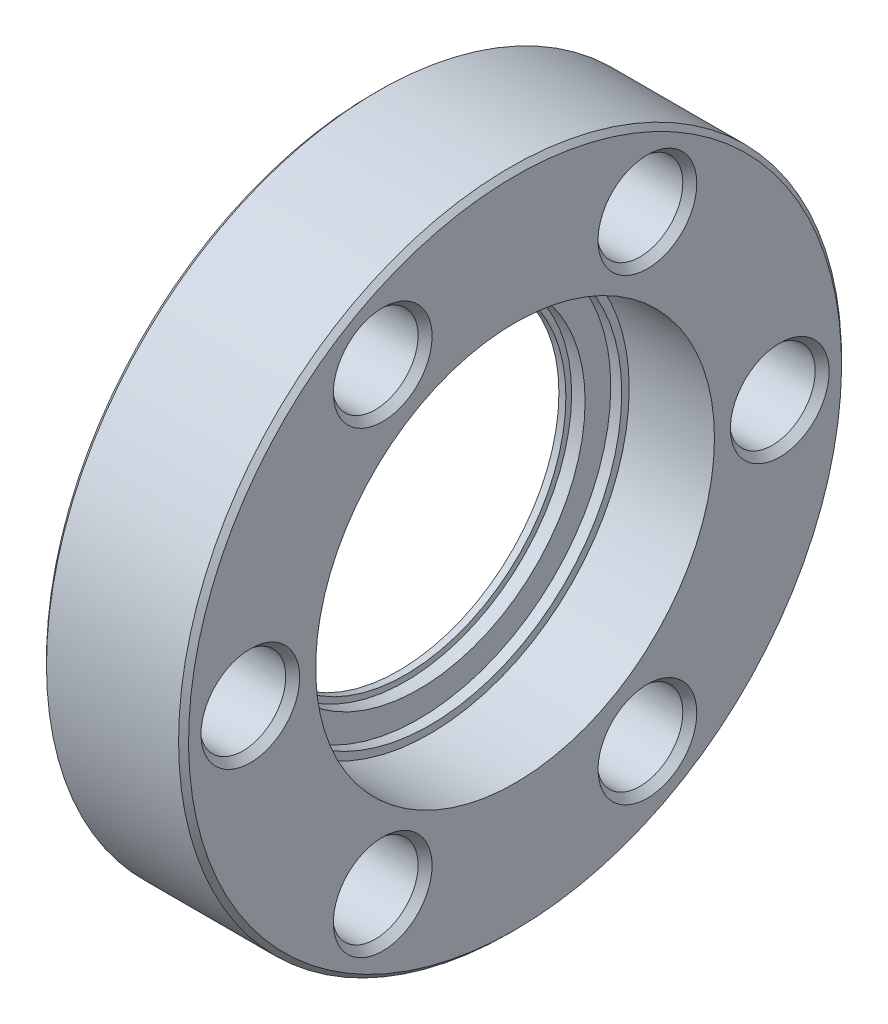
ISO-10303-21;
HEADER;
FILE_DESCRIPTION(('STEP AP214'),'2;1');
FILE_NAME('part.step','',(''),(''),'','','');
FILE_SCHEMA(('AUTOMOTIVE_DESIGN { 1 0 10303 214 1 1 1 1 }'));
ENDSEC;
DATA;
#1=APPLICATION_CONTEXT('core data for automotive mechanical design processes');
#2=APPLICATION_PROTOCOL_DEFINITION('international standard','automotive_design',2000,#1);
#3=PRODUCT_CONTEXT('',#1,'mechanical');
#4=PRODUCT('Part','Part','',(#3));
#5=PRODUCT_RELATED_PRODUCT_CATEGORY('part','',(#4));
#6=PRODUCT_DEFINITION_FORMATION('','',#4);
#7=PRODUCT_DEFINITION_CONTEXT('part definition',#1,'design');
#8=PRODUCT_DEFINITION('design','',#6,#7);
#9=PRODUCT_DEFINITION_SHAPE('','',#8);
#10=(LENGTH_UNIT() NAMED_UNIT(*) SI_UNIT(.MILLI.,.METRE.));
#11=(NAMED_UNIT(*) PLANE_ANGLE_UNIT() SI_UNIT($,.RADIAN.));
#12=(NAMED_UNIT(*) SI_UNIT($,.STERADIAN.) SOLID_ANGLE_UNIT());
#13=UNCERTAINTY_MEASURE_WITH_UNIT(LENGTH_MEASURE(1.E-05),#10,'distance_accuracy_value','');
#14=(GEOMETRIC_REPRESENTATION_CONTEXT(3) GLOBAL_UNCERTAINTY_ASSIGNED_CONTEXT((#13)) GLOBAL_UNIT_ASSIGNED_CONTEXT((#10,
#11,#12)) REPRESENTATION_CONTEXT('',''));
#15=CARTESIAN_POINT('',(0.,0.,0.));
#16=DIRECTION('',(0.,0.,1.));
#17=DIRECTION('',(1.,0.,0.));
#18=AXIS2_PLACEMENT_3D('',#15,#16,#17);
#19=CARTESIAN_POINT('',(1.2954,0.,0.));
#20=DIRECTION('',(1.,0.,0.));
#21=DIRECTION('',(0.,0.,-1.));
#22=AXIS2_PLACEMENT_3D('',#19,#20,#21);
#23=PLANE('',#22);
#24=CARTESIAN_POINT('',(1.2954,0.,0.));
#25=DIRECTION('',(-1.,0.,0.));
#26=DIRECTION('',(0.,0.,1.));
#27=AXIS2_PLACEMENT_3D('',#24,#25,#26);
#28=CIRCLE('',#27,9.144);
#29=CARTESIAN_POINT('',(1.2954,0.,9.144));
#30=VERTEX_POINT('',#29);
#31=EDGE_CURVE('E96',#30,#30,#28,.T.);
#32=ORIENTED_EDGE('',*,*,#31,.T.);
#33=EDGE_LOOP('',(#32));
#34=FACE_BOUND('',#33,.T.);
#35=CARTESIAN_POINT('',(1.2954,0.,0.));
#36=DIRECTION('',(1.,0.,0.));
#37=DIRECTION('',(0.,0.,-1.));
#38=AXIS2_PLACEMENT_3D('',#35,#36,#37);
#39=CIRCLE('',#38,8.1788);
#40=CARTESIAN_POINT('',(1.2954,0.,-8.1788));
#41=VERTEX_POINT('',#40);
#42=EDGE_CURVE('E18',#41,#41,#39,.T.);
#43=ORIENTED_EDGE('',*,*,#42,.T.);
#44=EDGE_LOOP('',(#43));
#45=FACE_BOUND('',#44,.T.);
#46=ADVANCED_FACE('F15',(#34,#45),#23,.F.);
#47=CARTESIAN_POINT('',(0.,0.,0.));
#48=DIRECTION('',(1.,0.,0.));
#49=DIRECTION('',(0.,0.,-1.));
#50=AXIS2_PLACEMENT_3D('',#47,#48,#49);
#51=CYLINDRICAL_SURFACE('',#50,8.1788);
#52=ORIENTED_EDGE('',*,*,#42,.F.);
#53=EDGE_LOOP('',(#52));
#54=FACE_BOUND('',#53,.T.);
#55=CARTESIAN_POINT('',(1.651,0.,0.));
#56=DIRECTION('',(1.,0.,0.));
#57=DIRECTION('',(0.,0.,-1.));
#58=AXIS2_PLACEMENT_3D('',#55,#56,#57);
#59=CIRCLE('',#58,8.1788);
#60=CARTESIAN_POINT('',(1.651,0.,-8.1788));
#61=VERTEX_POINT('',#60);
#62=EDGE_CURVE('E94',#61,#61,#59,.F.);
#63=ORIENTED_EDGE('',*,*,#62,.F.);
#64=EDGE_LOOP('',(#63));
#65=FACE_BOUND('',#64,.T.);
#66=ADVANCED_FACE('F104',(#54,#65),#51,.F.);
#67=CARTESIAN_POINT('',(1.2954,0.,0.));
#68=DIRECTION('',(-1.,0.,0.));
#69=DIRECTION('',(0.,0.,1.));
#70=AXIS2_PLACEMENT_3D('',#67,#68,#69);
#71=CYLINDRICAL_SURFACE('',#70,9.144);
#72=ORIENTED_EDGE('',*,*,#31,.F.);
#73=EDGE_LOOP('',(#72));
#74=FACE_BOUND('',#73,.T.);
#75=CARTESIAN_POINT('',(0.6604,0.,0.));
#76=DIRECTION('',(1.,0.,0.));
#77=DIRECTION('',(0.,0.,-1.));
#78=AXIS2_PLACEMENT_3D('',#75,#76,#77);
#79=CIRCLE('',#78,9.144);
#80=CARTESIAN_POINT('',(0.6604,0.,-9.144));
#81=VERTEX_POINT('',#80);
#82=EDGE_CURVE('E30',#81,#81,#79,.T.);
#83=ORIENTED_EDGE('',*,*,#82,.F.);
#84=EDGE_LOOP('',(#83));
#85=FACE_BOUND('',#84,.T.);
#86=ADVANCED_FACE('F107',(#74,#85),#71,.F.);
#87=CARTESIAN_POINT('',(1.651,0.,0.));
#88=DIRECTION('',(1.,0.,0.));
#89=DIRECTION('',(0.,0.,-1.));
#90=AXIS2_PLACEMENT_3D('',#87,#88,#89);
#91=PLANE('',#90);
#92=ORIENTED_EDGE('',*,*,#62,.T.);
#93=EDGE_LOOP('',(#92));
#94=FACE_BOUND('',#93,.T.);
#95=CARTESIAN_POINT('',(1.651,0.,0.));
#96=DIRECTION('',(1.,0.,0.));
#97=DIRECTION('',(0.,0.,-1.));
#98=AXIS2_PLACEMENT_3D('',#95,#96,#97);
#99=CIRCLE('',#98,8.4709);
#100=CARTESIAN_POINT('',(1.651,0.,-8.4709));
#101=VERTEX_POINT('',#100);
#102=EDGE_CURVE('E91',#101,#101,#99,.T.);
#103=ORIENTED_EDGE('',*,*,#102,.T.);
#104=EDGE_LOOP('',(#103));
#105=FACE_BOUND('',#104,.T.);
#106=ADVANCED_FACE('F110',(#94,#105),#91,.T.);
#107=CARTESIAN_POINT('',(1.2335803249224,0.,0.));
#108=DIRECTION('',(1.,0.,0.));
#109=DIRECTION('',(0.,0.,-1.));
#110=AXIS2_PLACEMENT_3D('',#107,#108,#109);
#111=CONICAL_SURFACE('',#110,10.7188,1.22173047639604);
#112=CARTESIAN_POINT('',(1.2335803249224,0.,0.));
#113=DIRECTION('',(1.,0.,0.));
#114=DIRECTION('',(0.,0.,-1.));
#115=AXIS2_PLACEMENT_3D('',#112,#113,#114);
#116=CIRCLE('',#115,10.7188);
#117=CARTESIAN_POINT('',(1.2335803249224,0.,-10.7188));
#118=VERTEX_POINT('',#117);
#119=EDGE_CURVE('E90',#118,#118,#116,.F.);
#120=ORIENTED_EDGE('',*,*,#119,.T.);
#121=EDGE_LOOP('',(#120));
#122=FACE_BOUND('',#121,.T.);
#123=ORIENTED_EDGE('',*,*,#82,.T.);
#124=EDGE_LOOP('',(#123));
#125=FACE_BOUND('',#124,.T.);
#126=ADVANCED_FACE('F113',(#122,#125),#111,.T.);
#127=CARTESIAN_POINT('',(1.651,0.,0.));
#128=DIRECTION('',(1.,0.,0.));
#129=DIRECTION('',(0.,0.,-1.));
#130=AXIS2_PLACEMENT_3D('',#127,#128,#129);
#131=CYLINDRICAL_SURFACE('',#130,8.4709);
#132=ORIENTED_EDGE('',*,*,#102,.F.);
#133=EDGE_LOOP('',(#132));
#134=FACE_BOUND('',#133,.T.);
#135=CARTESIAN_POINT('',(2.3368,0.,0.));
#136=DIRECTION('',(1.,0.,0.));
#137=DIRECTION('',(0.,0.,-1.));
#138=AXIS2_PLACEMENT_3D('',#135,#136,#137);
#139=CIRCLE('',#138,8.4709);
#140=CARTESIAN_POINT('',(2.3368,0.,-8.4709));
#141=VERTEX_POINT('',#140);
#142=EDGE_CURVE('E87',#141,#141,#139,.F.);
#143=ORIENTED_EDGE('',*,*,#142,.F.);
#144=EDGE_LOOP('',(#143));
#145=FACE_BOUND('',#144,.T.);
#146=ADVANCED_FACE('F117',(#134,#145),#131,.F.);
#147=CARTESIAN_POINT('',(7.239,0.,0.));
#148=DIRECTION('',(1.,0.,0.));
#149=DIRECTION('',(0.,0.,-1.));
#150=AXIS2_PLACEMENT_3D('',#147,#148,#149);
#151=CYLINDRICAL_SURFACE('',#150,10.7188);
#152=CARTESIAN_POINT('',(0.,0.,0.));
#153=DIRECTION('',(1.,0.,0.));
#154=DIRECTION('',(0.,0.,-1.));
#155=AXIS2_PLACEMENT_3D('',#152,#153,#154);
#156=CIRCLE('',#155,10.7188);
#157=CARTESIAN_POINT('',(0.,0.,-10.7188));
#158=VERTEX_POINT('',#157);
#159=EDGE_CURVE('E84',#158,#158,#156,.F.);
#160=ORIENTED_EDGE('',*,*,#159,.T.);
#161=EDGE_LOOP('',(#160));
#162=FACE_BOUND('',#161,.T.);
#163=ORIENTED_EDGE('',*,*,#119,.F.);
#164=EDGE_LOOP('',(#163));
#165=FACE_BOUND('',#164,.T.);
#166=ADVANCED_FACE('F120',(#162,#165),#151,.F.);
#167=CARTESIAN_POINT('',(2.3368,0.,0.));
#168=DIRECTION('',(1.,0.,0.));
#169=DIRECTION('',(0.,0.,-1.));
#170=AXIS2_PLACEMENT_3D('',#167,#168,#169);
#171=PLANE('',#170);
#172=ORIENTED_EDGE('',*,*,#142,.T.);
#173=EDGE_LOOP('',(#172));
#174=FACE_BOUND('',#173,.T.);
#175=CARTESIAN_POINT('',(2.3368,0.,0.));
#176=DIRECTION('',(1.,0.,0.));
#177=DIRECTION('',(0.,0.,-1.));
#178=AXIS2_PLACEMENT_3D('',#175,#176,#177);
#179=CIRCLE('',#178,9.779);
#180=CARTESIAN_POINT('',(2.3368,0.,-9.779));
#181=VERTEX_POINT('',#180);
#182=EDGE_CURVE('E81',#181,#181,#179,.T.);
#183=ORIENTED_EDGE('',*,*,#182,.T.);
#184=EDGE_LOOP('',(#183));
#185=FACE_BOUND('',#184,.T.);
#186=ADVANCED_FACE('F124',(#174,#185),#171,.T.);
#187=CARTESIAN_POINT('',(0.,0.,0.));
#188=DIRECTION('',(1.,0.,0.));
#189=DIRECTION('',(0.,0.,-1.));
#190=AXIS2_PLACEMENT_3D('',#187,#188,#189);
#191=PLANE('',#190);
#192=ORIENTED_EDGE('',*,*,#159,.F.);
#193=EDGE_LOOP('',(#192));
#194=FACE_BOUND('',#193,.T.);
#195=CARTESIAN_POINT('',(0.,0.,0.));
#196=DIRECTION('',(1.,0.,0.));
#197=DIRECTION('',(0.,0.,-1.));
#198=AXIS2_PLACEMENT_3D('',#195,#196,#197);
#199=CIRCLE('',#198,16.637);
#200=CARTESIAN_POINT('',(0.,0.,-16.637));
#201=VERTEX_POINT('',#200);
#202=EDGE_CURVE('E60',#201,#201,#199,.T.);
#203=ORIENTED_EDGE('',*,*,#202,.F.);
#204=EDGE_LOOP('',(#203));
#205=FACE_BOUND('',#204,.T.);
#206=CARTESIAN_POINT('',(0.,11.6804310310022,-6.74370000000002));
#207=DIRECTION('',(-1.,0.,0.));
#208=DIRECTION('',(0.,0.,1.));
#209=AXIS2_PLACEMENT_3D('',#206,#207,#208);
#210=CIRCLE('',#209,2.56540000002181);
#211=CARTESIAN_POINT('',(0.,11.6804310310022,-4.17829999997821));
#212=VERTEX_POINT('',#211);
#213=EDGE_CURVE('E63',#212,#212,#210,.F.);
#214=ORIENTED_EDGE('',*,*,#213,.T.);
#215=EDGE_LOOP('',(#214));
#216=FACE_BOUND('',#215,.T.);
#217=CARTESIAN_POINT('',(-5.6843418860808E-11,0.,-13.4874));
#218=DIRECTION('',(-1.,0.,0.));
#219=DIRECTION('',(0.,0.,1.));
#220=AXIS2_PLACEMENT_3D('',#217,#218,#219);
#221=CIRCLE('',#220,2.56540000004833);
#222=CARTESIAN_POINT('',(-5.6843418860808E-11,0.,-10.9219999999517));
#223=VERTEX_POINT('',#222);
#224=EDGE_CURVE('E66',#223,#223,#221,.F.);
#225=ORIENTED_EDGE('',*,*,#224,.T.);
#226=EDGE_LOOP('',(#225));
#227=FACE_BOUND('',#226,.T.);
#228=CARTESIAN_POINT('',(0.,-11.6804310310023,-6.74369999999993));
#229=DIRECTION('',(-1.,0.,0.));
#230=DIRECTION('',(0.,0.,1.));
#231=AXIS2_PLACEMENT_3D('',#228,#229,#230);
#232=CIRCLE('',#231,2.56539999996488);
#233=CARTESIAN_POINT('',(0.,-11.6804310310023,-4.17830000003505));
#234=VERTEX_POINT('',#233);
#235=EDGE_CURVE('E69',#234,#234,#232,.F.);
#236=ORIENTED_EDGE('',*,*,#235,.T.);
#237=EDGE_LOOP('',(#236));
#238=FACE_BOUND('',#237,.T.);
#239=CARTESIAN_POINT('',(0.,-11.6804310310022,6.7437000000001));
#240=DIRECTION('',(-1.,0.,0.));
#241=DIRECTION('',(0.,0.,1.));
#242=AXIS2_PLACEMENT_3D('',#239,#240,#241);
#243=CIRCLE('',#242,2.56539999999575);
#244=CARTESIAN_POINT('',(0.,-11.6804310310022,9.30909999999585));
#245=VERTEX_POINT('',#244);
#246=EDGE_CURVE('E72',#245,#245,#243,.F.);
#247=ORIENTED_EDGE('',*,*,#246,.T.);
#248=EDGE_LOOP('',(#247));
#249=FACE_BOUND('',#248,.T.);
#250=CARTESIAN_POINT('',(-5.6843418860808E-11,1.43982048506075E-13,13.4874));
#251=DIRECTION('',(-1.,0.,0.));
#252=DIRECTION('',(0.,0.,1.));
#253=AXIS2_PLACEMENT_3D('',#250,#251,#252);
#254=CIRCLE('',#253,2.5654000000113);
#255=CARTESIAN_POINT('',(-5.6843418860808E-11,1.43982048506075E-13,16.0528000000113));
#256=VERTEX_POINT('',#255);
#257=EDGE_CURVE('E75',#256,#256,#254,.F.);
#258=ORIENTED_EDGE('',*,*,#257,.T.);
#259=EDGE_LOOP('',(#258));
#260=FACE_BOUND('',#259,.T.);
#261=CARTESIAN_POINT('',(5.6843418860808E-11,11.6804310310023,6.74369999999985));
#262=DIRECTION('',(-1.,0.,0.));
#263=DIRECTION('',(0.,0.,1.));
#264=AXIS2_PLACEMENT_3D('',#261,#262,#263);
#265=CIRCLE('',#264,2.56540000009483);
#266=CARTESIAN_POINT('',(5.6843418860808E-11,11.6804310310023,9.30910000009468));
#267=VERTEX_POINT('',#266);
#268=EDGE_CURVE('E78',#267,#267,#265,.F.);
#269=ORIENTED_EDGE('',*,*,#268,.T.);
#270=EDGE_LOOP('',(#269));
#271=FACE_BOUND('',#270,.T.);
#272=ADVANCED_FACE('F127',(#194,#205,#216,#227,#238,#249,#260,#271),#191,.F.);
#273=CARTESIAN_POINT('',(2.3368,0.,0.));
#274=DIRECTION('',(1.,0.,0.));
#275=DIRECTION('',(0.,0.,-1.));
#276=AXIS2_PLACEMENT_3D('',#273,#274,#275);
#277=CYLINDRICAL_SURFACE('',#276,9.779);
#278=ORIENTED_EDGE('',*,*,#182,.F.);
#279=EDGE_LOOP('',(#278));
#280=FACE_BOUND('',#279,.T.);
#281=CARTESIAN_POINT('',(2.8956,0.,0.));
#282=DIRECTION('',(1.,0.,0.));
#283=DIRECTION('',(0.,0.,-1.));
#284=AXIS2_PLACEMENT_3D('',#281,#282,#283);
#285=CIRCLE('',#284,9.779);
#286=CARTESIAN_POINT('',(2.8956,0.,-9.779));
#287=VERTEX_POINT('',#286);
#288=EDGE_CURVE('E56',#287,#287,#285,.F.);
#289=ORIENTED_EDGE('',*,*,#288,.F.);
#290=EDGE_LOOP('',(#289));
#291=FACE_BOUND('',#290,.T.);
#292=ADVANCED_FACE('F131',(#280,#291),#277,.F.);
#293=CARTESIAN_POINT('',(1.70530256582424E-10,11.6804310310023,6.74369999999985));
#294=DIRECTION('',(-1.,0.,0.));
#295=DIRECTION('',(0.,0.,1.));
#296=AXIS2_PLACEMENT_3D('',#293,#294,#295);
#297=CONICAL_SURFACE('',#296,2.565399999996,0.715584993335024);
#298=CARTESIAN_POINT('',(0.438290363151198,11.6804310310023,6.74369999999985));
#299=DIRECTION('',(-1.,0.,0.));
#300=DIRECTION('',(0.,0.,1.));
#301=AXIS2_PLACEMENT_3D('',#298,#299,#300);
#302=CIRCLE('',#301,2.1844);
#303=CARTESIAN_POINT('',(0.438290363151198,11.6804310310023,8.92809999999985));
#304=VERTEX_POINT('',#303);
#305=EDGE_CURVE('E59',#304,#304,#302,.F.);
#306=ORIENTED_EDGE('',*,*,#305,.T.);
#307=EDGE_LOOP('',(#306));
#308=FACE_BOUND('',#307,.T.);
#309=ORIENTED_EDGE('',*,*,#268,.F.);
#310=EDGE_LOOP('',(#309));
#311=FACE_BOUND('',#310,.T.);
#312=ADVANCED_FACE('F134',(#308,#311),#297,.F.);
#313=CARTESIAN_POINT('',(-5.6843418860808E-11,1.43982048506075E-13,13.4874));
#314=DIRECTION('',(-1.,0.,0.));
#315=DIRECTION('',(0.,0.,1.));
#316=AXIS2_PLACEMENT_3D('',#313,#314,#315);
#317=CONICAL_SURFACE('',#316,2.5654000000113,0.715584993325368);
#318=CARTESIAN_POINT('',(0.438290363151205,1.43982048506075E-13,13.4874));
#319=DIRECTION('',(-1.,0.,0.));
#320=DIRECTION('',(0.,0.,1.));
#321=AXIS2_PLACEMENT_3D('',#318,#319,#320);
#322=CIRCLE('',#321,2.1844);
#323=CARTESIAN_POINT('',(0.438290363151205,1.43982048506075E-13,15.6718));
#324=VERTEX_POINT('',#323);
#325=EDGE_CURVE('E229',#324,#324,#322,.F.);
#326=ORIENTED_EDGE('',*,*,#325,.T.);
#327=EDGE_LOOP('',(#326));
#328=FACE_BOUND('',#327,.T.);
#329=ORIENTED_EDGE('',*,*,#257,.F.);
#330=EDGE_LOOP('',(#329));
#331=FACE_BOUND('',#330,.T.);
#332=ADVANCED_FACE('F307',(#328,#331),#317,.F.);
#333=CARTESIAN_POINT('',(0.,-11.6804310310022,6.7437000000001));
#334=DIRECTION('',(-1.,0.,0.));
#335=DIRECTION('',(0.,0.,1.));
#336=AXIS2_PLACEMENT_3D('',#333,#334,#335);
#337=CONICAL_SURFACE('',#336,2.56539999999575,0.715584993335024);
#338=CARTESIAN_POINT('',(0.438290363151198,-11.6804310310022,6.7437000000001));
#339=DIRECTION('',(-1.,0.,0.));
#340=DIRECTION('',(0.,0.,1.));
#341=AXIS2_PLACEMENT_3D('',#338,#339,#340);
#342=CIRCLE('',#341,2.1844);
#343=CARTESIAN_POINT('',(0.438290363151198,-11.6804310310022,8.9281000000001));
#344=VERTEX_POINT('',#343);
#345=EDGE_CURVE('E226',#344,#344,#342,.F.);
#346=ORIENTED_EDGE('',*,*,#345,.T.);
#347=EDGE_LOOP('',(#346));
#348=FACE_BOUND('',#347,.T.);
#349=ORIENTED_EDGE('',*,*,#246,.F.);
#350=EDGE_LOOP('',(#349));
#351=FACE_BOUND('',#350,.T.);
#352=ADVANCED_FACE('F317',(#348,#351),#337,.F.);
#353=CARTESIAN_POINT('',(0.,-11.6804310310023,-6.74369999999993));
#354=DIRECTION('',(-1.,0.,0.));
#355=DIRECTION('',(0.,0.,1.));
#356=AXIS2_PLACEMENT_3D('',#353,#354,#355);
#357=CONICAL_SURFACE('',#356,2.56539999996488,0.715584993325368);
#358=CARTESIAN_POINT('',(0.438290363151204,-11.6804310310023,-6.74369999999993));
#359=DIRECTION('',(-1.,0.,0.));
#360=DIRECTION('',(0.,0.,1.));
#361=AXIS2_PLACEMENT_3D('',#358,#359,#360);
#362=CIRCLE('',#361,2.1844);
#363=CARTESIAN_POINT('',(0.438290363151204,-11.6804310310023,-4.55929999999993));
#364=VERTEX_POINT('',#363);
#365=EDGE_CURVE('E223',#364,#364,#362,.F.);
#366=ORIENTED_EDGE('',*,*,#365,.T.);
#367=EDGE_LOOP('',(#366));
#368=FACE_BOUND('',#367,.T.);
#369=ORIENTED_EDGE('',*,*,#235,.F.);
#370=EDGE_LOOP('',(#369));
#371=FACE_BOUND('',#370,.T.);
#372=ADVANCED_FACE('F327',(#368,#371),#357,.F.);
#373=CARTESIAN_POINT('',(5.6843418860808E-11,0.,-13.4874));
#374=DIRECTION('',(-1.,0.,0.));
#375=DIRECTION('',(0.,0.,1.));
#376=AXIS2_PLACEMENT_3D('',#373,#374,#375);
#377=CONICAL_SURFACE('',#376,2.5653999999495,0.715584993335024);
#378=CARTESIAN_POINT('',(0.438290363151191,0.,-13.4874));
#379=DIRECTION('',(-1.,0.,0.));
#380=DIRECTION('',(0.,0.,1.));
#381=AXIS2_PLACEMENT_3D('',#378,#379,#380);
#382=CIRCLE('',#381,2.1844);
#383=CARTESIAN_POINT('',(0.438290363151191,0.,-11.303));
#384=VERTEX_POINT('',#383);
#385=EDGE_CURVE('E220',#384,#384,#382,.F.);
#386=ORIENTED_EDGE('',*,*,#385,.T.);
#387=EDGE_LOOP('',(#386));
#388=FACE_BOUND('',#387,.T.);
#389=ORIENTED_EDGE('',*,*,#224,.F.);
#390=EDGE_LOOP('',(#389));
#391=FACE_BOUND('',#390,.T.);
#392=ADVANCED_FACE('F337',(#388,#391),#377,.F.);
#393=CARTESIAN_POINT('',(0.,11.6804310310022,-6.74370000000002));
#394=DIRECTION('',(-1.,0.,0.));
#395=DIRECTION('',(0.,0.,1.));
#396=AXIS2_PLACEMENT_3D('',#393,#394,#395);
#397=CONICAL_SURFACE('',#396,2.56540000002181,0.715584993335024);
#398=CARTESIAN_POINT('',(0.438290363151198,11.6804310310022,-6.74370000000002));
#399=DIRECTION('',(-1.,0.,0.));
#400=DIRECTION('',(0.,0.,1.));
#401=AXIS2_PLACEMENT_3D('',#398,#399,#400);
#402=CIRCLE('',#401,2.1844);
#403=CARTESIAN_POINT('',(0.438290363151198,11.6804310310022,-4.55930000000002));
#404=VERTEX_POINT('',#403);
#405=EDGE_CURVE('E217',#404,#404,#402,.F.);
#406=ORIENTED_EDGE('',*,*,#405,.T.);
#407=EDGE_LOOP('',(#406));
#408=FACE_BOUND('',#407,.T.);
#409=ORIENTED_EDGE('',*,*,#213,.F.);
#410=EDGE_LOOP('',(#409));
#411=FACE_BOUND('',#410,.T.);
#412=ADVANCED_FACE('F347',(#408,#411),#397,.F.);
#413=CARTESIAN_POINT('',(0.253999999999993,0.,0.));
#414=DIRECTION('',(1.,0.,0.));
#415=DIRECTION('',(0.,0.,-1.));
#416=AXIS2_PLACEMENT_3D('',#413,#414,#415);
#417=CONICAL_SURFACE('',#416,16.891,0.785398163397442);
#418=CARTESIAN_POINT('',(0.253999999999994,0.,0.));
#419=DIRECTION('',(-1.,0.,0.));
#420=DIRECTION('',(0.,0.,1.));
#421=AXIS2_PLACEMENT_3D('',#418,#419,#420);
#422=CIRCLE('',#421,16.891);
#423=CARTESIAN_POINT('',(0.253999999999994,0.,16.891));
#424=VERTEX_POINT('',#423);
#425=EDGE_CURVE('E55',#424,#424,#422,.F.);
#426=ORIENTED_EDGE('',*,*,#425,.F.);
#427=EDGE_LOOP('',(#426));
#428=FACE_BOUND('',#427,.T.);
#429=ORIENTED_EDGE('',*,*,#202,.T.);
#430=EDGE_LOOP('',(#429));
#431=FACE_BOUND('',#430,.T.);
#432=ADVANCED_FACE('F142',(#428,#431),#417,.T.);
#433=CARTESIAN_POINT('',(2.8956,0.,0.));
#434=DIRECTION('',(1.,0.,0.));
#435=DIRECTION('',(0.,0.,-1.));
#436=AXIS2_PLACEMENT_3D('',#433,#434,#435);
#437=PLANE('',#436);
#438=ORIENTED_EDGE('',*,*,#288,.T.);
#439=EDGE_LOOP('',(#438));
#440=FACE_BOUND('',#439,.T.);
#441=CARTESIAN_POINT('',(2.8956,0.,0.));
#442=DIRECTION('',(1.,0.,0.));
#443=DIRECTION('',(0.,0.,-1.));
#444=AXIS2_PLACEMENT_3D('',#441,#442,#443);
#445=CIRCLE('',#444,10.16);
#446=CARTESIAN_POINT('',(2.8956,0.,-10.16));
#447=VERTEX_POINT('',#446);
#448=EDGE_CURVE('E51',#447,#447,#445,.T.);
#449=ORIENTED_EDGE('',*,*,#448,.T.);
#450=EDGE_LOOP('',(#449));
#451=FACE_BOUND('',#450,.T.);
#452=ADVANCED_FACE('F138',(#440,#451),#437,.T.);
#453=CARTESIAN_POINT('',(7.239,11.6804310310023,6.74369999999985));
#454=DIRECTION('',(-1.,0.,0.));
#455=DIRECTION('',(0.,0.,1.));
#456=AXIS2_PLACEMENT_3D('',#453,#454,#455);
#457=CYLINDRICAL_SURFACE('',#456,2.1844);
#458=CARTESIAN_POINT('',(6.85800000002246,11.6804310310023,6.74369999999985));
#459=DIRECTION('',(1.,0.,0.));
#460=DIRECTION('',(0.,0.,-1.));
#461=AXIS2_PLACEMENT_3D('',#458,#459,#460);
#462=CIRCLE('',#461,2.18439999990355);
#463=CARTESIAN_POINT('',(6.85800000002246,11.6804310310023,4.5593000000963));
#464=VERTEX_POINT('',#463);
#465=EDGE_CURVE('E54',#464,#464,#462,.T.);
#466=ORIENTED_EDGE('',*,*,#465,.T.);
#467=EDGE_LOOP('',(#466));
#468=FACE_BOUND('',#467,.T.);
#469=ORIENTED_EDGE('',*,*,#305,.F.);
#470=EDGE_LOOP('',(#469));
#471=FACE_BOUND('',#470,.T.);
#472=ADVANCED_FACE('F141',(#468,#471),#457,.F.);
#473=CARTESIAN_POINT('',(7.239,1.43982048506075E-13,13.4874));
#474=DIRECTION('',(-1.,0.,0.));
#475=DIRECTION('',(0.,0.,1.));
#476=AXIS2_PLACEMENT_3D('',#473,#474,#475);
#477=CYLINDRICAL_SURFACE('',#476,2.1844);
#478=CARTESIAN_POINT('',(6.85800000002246,1.43982048506075E-13,13.4874));
#479=DIRECTION('',(1.,0.,0.));
#480=DIRECTION('',(0.,0.,-1.));
#481=AXIS2_PLACEMENT_3D('',#478,#479,#480);
#482=CIRCLE('',#481,2.18440000000194);
#483=CARTESIAN_POINT('',(6.85800000002246,1.43982048506075E-13,11.3029999999981));
#484=VERTEX_POINT('',#483);
#485=EDGE_CURVE('E198',#484,#484,#482,.T.);
#486=ORIENTED_EDGE('',*,*,#485,.T.);
#487=EDGE_LOOP('',(#486));
#488=FACE_BOUND('',#487,.T.);
#489=ORIENTED_EDGE('',*,*,#325,.F.);
#490=EDGE_LOOP('',(#489));
#491=FACE_BOUND('',#490,.T.);
#492=ADVANCED_FACE('F381',(#488,#491),#477,.F.);
#493=CARTESIAN_POINT('',(7.239,-11.6804310310022,6.7437000000001));
#494=DIRECTION('',(-1.,0.,0.));
#495=DIRECTION('',(0.,0.,1.));
#496=AXIS2_PLACEMENT_3D('',#493,#494,#495);
#497=CYLINDRICAL_SURFACE('',#496,2.1844);
#498=CARTESIAN_POINT('',(6.85800000002246,-11.6804310310022,6.7437000000001));
#499=DIRECTION('',(1.,0.,0.));
#500=DIRECTION('',(0.,0.,-1.));
#501=AXIS2_PLACEMENT_3D('',#498,#499,#500);
#502=CIRCLE('',#501,2.18440000001749);
#503=CARTESIAN_POINT('',(6.85800000002246,-11.6804310310022,4.55929999998261));
#504=VERTEX_POINT('',#503);
#505=EDGE_CURVE('E206',#504,#504,#502,.T.);
#506=ORIENTED_EDGE('',*,*,#505,.T.);
#507=EDGE_LOOP('',(#506));
#508=FACE_BOUND('',#507,.T.);
#509=ORIENTED_EDGE('',*,*,#345,.F.);
#510=EDGE_LOOP('',(#509));
#511=FACE_BOUND('',#510,.T.);
#512=ADVANCED_FACE('F391',(#508,#511),#497,.F.);
#513=CARTESIAN_POINT('',(7.239,-11.6804310310023,-6.74369999999993));
#514=DIRECTION('',(-1.,0.,0.));
#515=DIRECTION('',(0.,0.,1.));
#516=AXIS2_PLACEMENT_3D('',#513,#514,#515);
#517=CYLINDRICAL_SURFACE('',#516,2.1844);
#518=CARTESIAN_POINT('',(6.85799999996561,-11.6804310310023,-6.74369999999993));
#519=DIRECTION('',(1.,0.,0.));
#520=DIRECTION('',(0.,0.,-1.));
#521=AXIS2_PLACEMENT_3D('',#518,#519,#520);
#522=CIRCLE('',#521,2.18440000004836);
#523=CARTESIAN_POINT('',(6.85799999996561,-11.6804310310023,-8.92810000004829));
#524=VERTEX_POINT('',#523);
#525=EDGE_CURVE('E209',#524,#524,#522,.T.);
#526=ORIENTED_EDGE('',*,*,#525,.T.);
#527=EDGE_LOOP('',(#526));
#528=FACE_BOUND('',#527,.T.);
#529=ORIENTED_EDGE('',*,*,#365,.F.);
#530=EDGE_LOOP('',(#529));
#531=FACE_BOUND('',#530,.T.);
#532=ADVANCED_FACE('F400',(#528,#531),#517,.F.);
#533=CARTESIAN_POINT('',(7.239,0.,-13.4874));
#534=DIRECTION('',(-1.,0.,0.));
#535=DIRECTION('',(0.,0.,1.));
#536=AXIS2_PLACEMENT_3D('',#533,#534,#535);
#537=CYLINDRICAL_SURFACE('',#536,2.1844);
#538=CARTESIAN_POINT('',(6.85799999996561,0.,-13.4874));
#539=DIRECTION('',(1.,0.,0.));
#540=DIRECTION('',(0.,0.,-1.));
#541=AXIS2_PLACEMENT_3D('',#538,#539,#540);
#542=CIRCLE('',#541,2.18439999995005);
#543=CARTESIAN_POINT('',(6.85799999996561,0.,-15.6717999999501));
#544=VERTEX_POINT('',#543);
#545=EDGE_CURVE('E512',#544,#544,#542,.T.);
#546=ORIENTED_EDGE('',*,*,#545,.T.);
#547=EDGE_LOOP('',(#546));
#548=FACE_BOUND('',#547,.T.);
#549=ORIENTED_EDGE('',*,*,#385,.F.);
#550=EDGE_LOOP('',(#549));
#551=FACE_BOUND('',#550,.T.);
#552=ADVANCED_FACE('F410',(#548,#551),#537,.F.);
#553=CARTESIAN_POINT('',(7.239,11.6804310310022,-6.74370000000002));
#554=DIRECTION('',(-1.,0.,0.));
#555=DIRECTION('',(0.,0.,1.));
#556=AXIS2_PLACEMENT_3D('',#553,#554,#555);
#557=CYLINDRICAL_SURFACE('',#556,2.1844);
#558=CARTESIAN_POINT('',(6.85800000002246,11.6804310310022,-6.74370000000002));
#559=DIRECTION('',(1.,0.,0.));
#560=DIRECTION('',(0.,0.,-1.));
#561=AXIS2_PLACEMENT_3D('',#558,#559,#560);
#562=CIRCLE('',#561,2.18440000004827);
#563=CARTESIAN_POINT('',(6.85800000002246,11.6804310310022,-8.92810000004829));
#564=VERTEX_POINT('',#563);
#565=EDGE_CURVE('E492',#564,#564,#562,.T.);
#566=ORIENTED_EDGE('',*,*,#565,.T.);
#567=EDGE_LOOP('',(#566));
#568=FACE_BOUND('',#567,.T.);
#569=ORIENTED_EDGE('',*,*,#405,.F.);
#570=EDGE_LOOP('',(#569));
#571=FACE_BOUND('',#570,.T.);
#572=ADVANCED_FACE('F160',(#568,#571),#557,.F.);
#573=CARTESIAN_POINT('',(7.239,0.,0.));
#574=DIRECTION('',(-1.,0.,0.));
#575=DIRECTION('',(0.,0.,1.));
#576=AXIS2_PLACEMENT_3D('',#573,#574,#575);
#577=CYLINDRICAL_SURFACE('',#576,16.891);
#578=ORIENTED_EDGE('',*,*,#425,.T.);
#579=EDGE_LOOP('',(#578));
#580=FACE_BOUND('',#579,.T.);
#581=CARTESIAN_POINT('',(6.98500000000001,0.,0.));
#582=DIRECTION('',(-1.,0.,0.));
#583=DIRECTION('',(0.,0.,1.));
#584=AXIS2_PLACEMENT_3D('',#581,#582,#583);
#585=CIRCLE('',#584,16.891);
#586=CARTESIAN_POINT('',(6.98500000000001,0.,16.891));
#587=VERTEX_POINT('',#586);
#588=EDGE_CURVE('E50',#587,#587,#585,.F.);
#589=ORIENTED_EDGE('',*,*,#588,.F.);
#590=EDGE_LOOP('',(#589));
#591=FACE_BOUND('',#590,.T.);
#592=ADVANCED_FACE('F149',(#580,#591),#577,.T.);
#593=CARTESIAN_POINT('',(2.8956,0.,0.));
#594=DIRECTION('',(1.,0.,0.));
#595=DIRECTION('',(0.,0.,-1.));
#596=AXIS2_PLACEMENT_3D('',#593,#594,#595);
#597=CYLINDRICAL_SURFACE('',#596,10.16);
#598=CARTESIAN_POINT('',(7.239,0.,0.));
#599=DIRECTION('',(1.,0.,0.));
#600=DIRECTION('',(0.,0.,-1.));
#601=AXIS2_PLACEMENT_3D('',#598,#599,#600);
#602=CIRCLE('',#601,10.16);
#603=CARTESIAN_POINT('',(7.239,0.,-10.16));
#604=VERTEX_POINT('',#603);
#605=EDGE_CURVE('E47',#604,#604,#602,.F.);
#606=ORIENTED_EDGE('',*,*,#605,.F.);
#607=EDGE_LOOP('',(#606));
#608=FACE_BOUND('',#607,.T.);
#609=ORIENTED_EDGE('',*,*,#448,.F.);
#610=EDGE_LOOP('',(#609));
#611=FACE_BOUND('',#610,.T.);
#612=ADVANCED_FACE('F146',(#608,#611),#597,.F.);
#613=CARTESIAN_POINT('',(7.23900000002686,11.6804310310023,6.74369999999985));
#614=DIRECTION('',(1.,0.,0.));
#615=DIRECTION('',(0.,1.,0.));
#616=AXIS2_PLACEMENT_3D('',#613,#614,#615);
#617=CONICAL_SURFACE('',#616,2.51559824708497,0.715584993421736);
#618=ORIENTED_EDGE('',*,*,#465,.F.);
#619=EDGE_LOOP('',(#618));
#620=FACE_BOUND('',#619,.T.);
#621=CARTESIAN_POINT('',(7.23900000002686,11.6804310310023,6.74369999999985));
#622=DIRECTION('',(1.,0.,0.));
#623=DIRECTION('',(0.,1.,0.));
#624=AXIS2_PLACEMENT_3D('',#621,#622,#623);
#625=CIRCLE('',#624,2.51559824708497);
#626=CARTESIAN_POINT('',(7.23900000002686,14.1960292780873,6.74369999999985));
#627=VERTEX_POINT('',#626);
#628=EDGE_CURVE('E44',#627,#627,#625,.F.);
#629=ORIENTED_EDGE('',*,*,#628,.F.);
#630=EDGE_LOOP('',(#629));
#631=FACE_BOUND('',#630,.T.);
#632=ADVANCED_FACE('F148',(#620,#631),#617,.F.);
#633=CARTESIAN_POINT('',(7.23900000002686,1.43982048506075E-13,13.4874));
#634=DIRECTION('',(1.,0.,0.));
#635=DIRECTION('',(0.,1.,0.));
#636=AXIS2_PLACEMENT_3D('',#633,#634,#635);
#637=CONICAL_SURFACE('',#636,2.51559824712651,0.715584993358972);
#638=ORIENTED_EDGE('',*,*,#485,.F.);
#639=EDGE_LOOP('',(#638));
#640=FACE_BOUND('',#639,.T.);
#641=CARTESIAN_POINT('',(7.23900000002686,1.43982048506075E-13,13.4874));
#642=DIRECTION('',(1.,0.,0.));
#643=DIRECTION('',(0.,1.,0.));
#644=AXIS2_PLACEMENT_3D('',#641,#642,#643);
#645=CIRCLE('',#644,2.51559824712651);
#646=CARTESIAN_POINT('',(7.23900000002686,2.51559824712666,13.4874));
#647=VERTEX_POINT('',#646);
#648=EDGE_CURVE('E41',#647,#647,#645,.F.);
#649=ORIENTED_EDGE('',*,*,#648,.F.);
#650=EDGE_LOOP('',(#649));
#651=FACE_BOUND('',#650,.T.);
#652=ADVANCED_FACE('F157',(#640,#651),#637,.F.);
#653=CARTESIAN_POINT('',(7.23899999997002,-11.6804310310022,6.7437000000001));
#654=DIRECTION('',(1.,0.,0.));
#655=DIRECTION('',(0.,0.,-1.));
#656=AXIS2_PLACEMENT_3D('',#653,#654,#655);
#657=CONICAL_SURFACE('',#656,2.51559824708522,0.715584993325648);
#658=ORIENTED_EDGE('',*,*,#505,.F.);
#659=EDGE_LOOP('',(#658));
#660=FACE_BOUND('',#659,.T.);
#661=CARTESIAN_POINT('',(7.23899999997002,-11.6804310310022,6.7437000000001));
#662=DIRECTION('',(1.,0.,0.));
#663=DIRECTION('',(0.,0.,-1.));
#664=AXIS2_PLACEMENT_3D('',#661,#662,#663);
#665=CIRCLE('',#664,2.51559824708522);
#666=CARTESIAN_POINT('',(7.23899999997002,-11.6804310310022,4.22810175291488));
#667=VERTEX_POINT('',#666);
#668=EDGE_CURVE('E38',#667,#667,#665,.F.);
#669=ORIENTED_EDGE('',*,*,#668,.F.);
#670=EDGE_LOOP('',(#669));
#671=FACE_BOUND('',#670,.T.);
#672=ADVANCED_FACE('F186',(#660,#671),#657,.F.);
#673=CARTESIAN_POINT('',(7.23899999979949,-11.6804310310023,-6.74369999999993));
#674=DIRECTION('',(1.,0.,0.));
#675=DIRECTION('',(0.,0.,-1.));
#676=AXIS2_PLACEMENT_3D('',#673,#674,#675);
#677=CONICAL_SURFACE('',#676,2.5155982470024,0.715584993336756);
#678=ORIENTED_EDGE('',*,*,#525,.F.);
#679=EDGE_LOOP('',(#678));
#680=FACE_BOUND('',#679,.T.);
#681=CARTESIAN_POINT('',(7.23899999997002,-11.6804310310023,-6.74369999999993));
#682=DIRECTION('',(1.,0.,0.));
#683=DIRECTION('',(0.,0.,-1.));
#684=AXIS2_PLACEMENT_3D('',#681,#682,#683);
#685=CIRCLE('',#684,2.51559824715064);
#686=CARTESIAN_POINT('',(7.23899999997002,-11.6804310310023,-9.25929824715057));
#687=VERTEX_POINT('',#686);
#688=EDGE_CURVE('E35',#687,#687,#685,.F.);
#689=ORIENTED_EDGE('',*,*,#688,.F.);
#690=EDGE_LOOP('',(#689));
#691=FACE_BOUND('',#690,.T.);
#692=ADVANCED_FACE('F182',(#680,#691),#677,.F.);
#693=CARTESIAN_POINT('',(7.23899999997002,0.,-13.4874));
#694=DIRECTION('',(1.,0.,0.));
#695=DIRECTION('',(0.,0.,-1.));
#696=AXIS2_PLACEMENT_3D('',#693,#694,#695);
#697=CONICAL_SURFACE('',#696,2.51559824707463,0.715584993336756);
#698=ORIENTED_EDGE('',*,*,#545,.F.);
#699=EDGE_LOOP('',(#698));
#700=FACE_BOUND('',#699,.T.);
#701=CARTESIAN_POINT('',(7.23899999997002,0.,-13.4874));
#702=DIRECTION('',(1.,0.,0.));
#703=DIRECTION('',(0.,0.,-1.));
#704=AXIS2_PLACEMENT_3D('',#701,#702,#703);
#705=CIRCLE('',#704,2.51559824707463);
#706=CARTESIAN_POINT('',(7.23899999997002,0.,-16.0029982470746));
#707=VERTEX_POINT('',#706);
#708=EDGE_CURVE('E27',#707,#707,#705,.F.);
#709=ORIENTED_EDGE('',*,*,#708,.F.);
#710=EDGE_LOOP('',(#709));
#711=FACE_BOUND('',#710,.T.);
#712=ADVANCED_FACE('F178',(#700,#711),#697,.F.);
#713=CARTESIAN_POINT('',(7.23899999997002,11.6804310310022,-6.74370000000002));
#714=DIRECTION('',(1.,0.,0.));
#715=DIRECTION('',(0.,0.,-1.));
#716=AXIS2_PLACEMENT_3D('',#713,#714,#715);
#717=CONICAL_SURFACE('',#716,2.515598247116,0.715584993325648);
#718=ORIENTED_EDGE('',*,*,#565,.F.);
#719=EDGE_LOOP('',(#718));
#720=FACE_BOUND('',#719,.T.);
#721=CARTESIAN_POINT('',(7.23899999997002,11.6804310310022,-6.74370000000002));
#722=DIRECTION('',(1.,0.,0.));
#723=DIRECTION('',(0.,0.,-1.));
#724=AXIS2_PLACEMENT_3D('',#721,#722,#723);
#725=CIRCLE('',#724,2.515598247116);
#726=CARTESIAN_POINT('',(7.23899999997002,11.6804310310022,-9.25929824711602));
#727=VERTEX_POINT('',#726);
#728=EDGE_CURVE('E22',#727,#727,#725,.F.);
#729=ORIENTED_EDGE('',*,*,#728,.F.);
#730=EDGE_LOOP('',(#729));
#731=FACE_BOUND('',#730,.T.);
#732=ADVANCED_FACE('F171',(#720,#731),#717,.F.);
#733=CARTESIAN_POINT('',(6.98500000000001,0.,0.));
#734=DIRECTION('',(-1.,0.,0.));
#735=DIRECTION('',(0.,-1.,0.));
#736=AXIS2_PLACEMENT_3D('',#733,#734,#735);
#737=CONICAL_SURFACE('',#736,16.891,0.78539816339746);
#738=ORIENTED_EDGE('',*,*,#588,.T.);
#739=EDGE_LOOP('',(#738));
#740=FACE_BOUND('',#739,.T.);
#741=CARTESIAN_POINT('',(7.239,0.,0.));
#742=DIRECTION('',(-1.,0.,0.));
#743=DIRECTION('',(0.,-1.,0.));
#744=AXIS2_PLACEMENT_3D('',#741,#742,#743);
#745=CIRCLE('',#744,16.637);
#746=CARTESIAN_POINT('',(7.239,-16.637,0.));
#747=VERTEX_POINT('',#746);
#748=EDGE_CURVE('E10',#747,#747,#745,.F.);
#749=ORIENTED_EDGE('',*,*,#748,.F.);
#750=EDGE_LOOP('',(#749));
#751=FACE_BOUND('',#750,.T.);
#752=ADVANCED_FACE('F166',(#740,#751),#737,.T.);
#753=CARTESIAN_POINT('',(7.239,0.,0.));
#754=DIRECTION('',(1.,0.,0.));
#755=DIRECTION('',(0.,0.,-1.));
#756=AXIS2_PLACEMENT_3D('',#753,#754,#755);
#757=PLANE('',#756);
#758=ORIENTED_EDGE('',*,*,#748,.T.);
#759=EDGE_LOOP('',(#758));
#760=FACE_BOUND('',#759,.T.);
#761=ORIENTED_EDGE('',*,*,#728,.T.);
#762=EDGE_LOOP('',(#761));
#763=FACE_BOUND('',#762,.T.);
#764=ORIENTED_EDGE('',*,*,#708,.T.);
#765=EDGE_LOOP('',(#764));
#766=FACE_BOUND('',#765,.T.);
#767=ORIENTED_EDGE('',*,*,#688,.T.);
#768=EDGE_LOOP('',(#767));
#769=FACE_BOUND('',#768,.T.);
#770=ORIENTED_EDGE('',*,*,#668,.T.);
#771=EDGE_LOOP('',(#770));
#772=FACE_BOUND('',#771,.T.);
#773=ORIENTED_EDGE('',*,*,#648,.T.);
#774=EDGE_LOOP('',(#773));
#775=FACE_BOUND('',#774,.T.);
#776=ORIENTED_EDGE('',*,*,#628,.T.);
#777=EDGE_LOOP('',(#776));
#778=FACE_BOUND('',#777,.T.);
#779=ORIENTED_EDGE('',*,*,#605,.T.);
#780=EDGE_LOOP('',(#779));
#781=FACE_BOUND('',#780,.T.);
#782=ADVANCED_FACE('F164',(#760,#763,#766,#769,#772,#775,#778,#781),#757,.T.);
#783=CLOSED_SHELL('',(#46,#66,#86,#106,#126,#146,#166,#186,#272,#292,#312,#332,#352,#372,#392,
#412,#432,#452,#472,#492,#512,#532,#552,#572,#592,#612,#632,#652,#672,#692,#712,#732,#752,#782));
#784=MANIFOLD_SOLID_BREP('B1',#783);
#785=ADVANCED_BREP_SHAPE_REPRESENTATION('',(#18,#784),#14);
#786=SHAPE_DEFINITION_REPRESENTATION(#9,#785);
ENDSEC;
END-ISO-10303-21;
